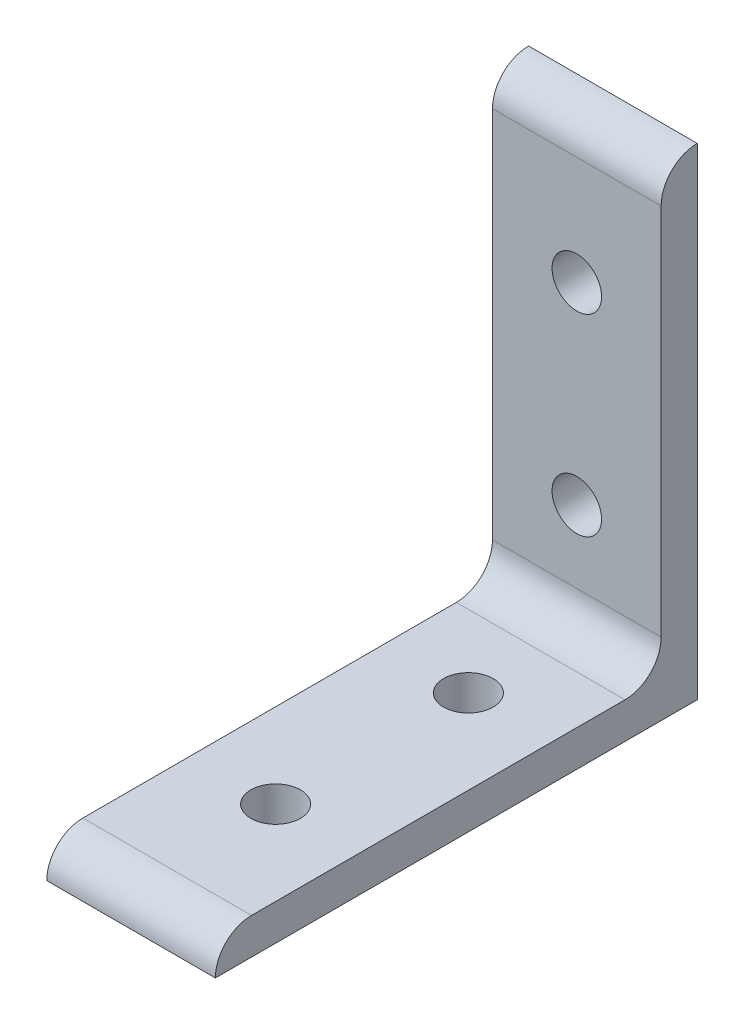
ISO-10303-21;
HEADER;
FILE_DESCRIPTION(('STEP AP214'),'2;1');
FILE_NAME('part.step','',(''),(''),'','','');
FILE_SCHEMA(('AUTOMOTIVE_DESIGN { 1 0 10303 214 1 1 1 1 }'));
ENDSEC;
DATA;
#1=APPLICATION_CONTEXT('core data for automotive mechanical design processes');
#2=APPLICATION_PROTOCOL_DEFINITION('international standard','automotive_design',2000,#1);
#3=PRODUCT_CONTEXT('',#1,'mechanical');
#4=PRODUCT('Part','Part','',(#3));
#5=PRODUCT_RELATED_PRODUCT_CATEGORY('part','',(#4));
#6=PRODUCT_DEFINITION_FORMATION('','',#4);
#7=PRODUCT_DEFINITION_CONTEXT('part definition',#1,'design');
#8=PRODUCT_DEFINITION('design','',#6,#7);
#9=PRODUCT_DEFINITION_SHAPE('','',#8);
#10=(LENGTH_UNIT() NAMED_UNIT(*) SI_UNIT(.MILLI.,.METRE.));
#11=(NAMED_UNIT(*) PLANE_ANGLE_UNIT() SI_UNIT($,.RADIAN.));
#12=(NAMED_UNIT(*) SI_UNIT($,.STERADIAN.) SOLID_ANGLE_UNIT());
#13=UNCERTAINTY_MEASURE_WITH_UNIT(LENGTH_MEASURE(1.E-05),#10,'distance_accuracy_value','');
#14=(GEOMETRIC_REPRESENTATION_CONTEXT(3) GLOBAL_UNCERTAINTY_ASSIGNED_CONTEXT((#13)) GLOBAL_UNIT_ASSIGNED_CONTEXT((#10,
#11,#12)) REPRESENTATION_CONTEXT('',''));
#15=CARTESIAN_POINT('',(0.,0.,0.));
#16=DIRECTION('',(0.,0.,1.));
#17=DIRECTION('',(1.,0.,0.));
#18=AXIS2_PLACEMENT_3D('',#15,#16,#17);
#19=CARTESIAN_POINT('',(-11.1125,58.7427923729418,0.0052899634717105));
#20=DIRECTION('',(1.,0.,0.));
#21=DIRECTION('',(0.,0.,-1.));
#22=AXIS2_PLACEMENT_3D('',#19,#20,#21);
#23=CYLINDRICAL_SURFACE('',#22,4.7625);
#24=CARTESIAN_POINT('',(11.1125,58.7427923729418,0.0052899634717105));
#25=DIRECTION('',(1.,0.,0.));
#26=DIRECTION('',(0.,0.,-1.));
#27=AXIS2_PLACEMENT_3D('',#24,#25,#26);
#28=CIRCLE('',#27,4.7625);
#29=CARTESIAN_POINT('',(11.1125,63.5052923729418,0.00528996347171051));
#30=VERTEX_POINT('',#29);
#31=CARTESIAN_POINT('',(11.1125,58.7427923729418,4.76778996347171));
#32=VERTEX_POINT('',#31);
#33=EDGE_CURVE('E131',#30,#32,#28,.T.);
#34=ORIENTED_EDGE('',*,*,#33,.F.);
#35=DIRECTION('',(1.,0.,0.));
#36=VECTOR('',#35,1.);
#37=CARTESIAN_POINT('',(-11.1125,63.5052923729418,0.00528996347171051));
#38=LINE('',#37,#36);
#39=CARTESIAN_POINT('',(-11.1125,63.5052923729418,0.00528996347171051));
#40=VERTEX_POINT('',#39);
#41=EDGE_CURVE('E113',#40,#30,#38,.T.);
#42=ORIENTED_EDGE('',*,*,#41,.F.);
#43=CARTESIAN_POINT('',(-11.1125,58.7427923729418,0.0052899634717105));
#44=DIRECTION('',(1.,0.,0.));
#45=DIRECTION('',(0.,0.,-1.));
#46=AXIS2_PLACEMENT_3D('',#43,#44,#45);
#47=CIRCLE('',#46,4.7625);
#48=CARTESIAN_POINT('',(-11.1125,58.7427923729418,4.76778996347171));
#49=VERTEX_POINT('',#48);
#50=EDGE_CURVE('E108',#40,#49,#47,.T.);
#51=ORIENTED_EDGE('',*,*,#50,.T.);
#52=DIRECTION('',(1.,0.,0.));
#53=VECTOR('',#52,1.);
#54=CARTESIAN_POINT('',(-11.1125,58.7427923729418,4.76778996347171));
#55=LINE('',#54,#53);
#56=EDGE_CURVE('E90',#49,#32,#55,.T.);
#57=ORIENTED_EDGE('',*,*,#56,.T.);
#58=EDGE_LOOP('',(#34,#42,#51,#57));
#59=FACE_BOUND('',#58,.T.);
#60=ADVANCED_FACE('F33',(#59),#23,.T.);
#61=CARTESIAN_POINT('',(-11.1125,0.00529237294180183,0.00528996347171065));
#62=DIRECTION('',(0.,0.,-1.));
#63=DIRECTION('',(0.,1.,0.));
#64=AXIS2_PLACEMENT_3D('',#61,#62,#63);
#65=PLANE('',#64);
#66=CARTESIAN_POINT('',(0.,19.0552923729418,0.00528996347170945));
#67=DIRECTION('',(0.,0.,-1.));
#68=DIRECTION('',(0.,1.,0.));
#69=AXIS2_PLACEMENT_3D('',#66,#67,#68);
#70=CIRCLE('',#69,3.26389999999998);
#71=CARTESIAN_POINT('',(0.,22.3191923729418,0.00528996347170945));
#72=VERTEX_POINT('',#71);
#73=EDGE_CURVE('E161',#72,#72,#70,.T.);
#74=ORIENTED_EDGE('',*,*,#73,.F.);
#75=EDGE_LOOP('',(#74));
#76=FACE_BOUND('',#75,.T.);
#77=CARTESIAN_POINT('',(0.,44.4552923729418,0.0052899634717094));
#78=DIRECTION('',(0.,0.,-1.));
#79=DIRECTION('',(0.,1.,0.));
#80=AXIS2_PLACEMENT_3D('',#77,#78,#79);
#81=CIRCLE('',#80,3.26389999999998);
#82=CARTESIAN_POINT('',(0.,47.7191923729418,0.00528996347170939));
#83=VERTEX_POINT('',#82);
#84=EDGE_CURVE('E157',#83,#83,#81,.T.);
#85=ORIENTED_EDGE('',*,*,#84,.F.);
#86=EDGE_LOOP('',(#85));
#87=FACE_BOUND('',#86,.T.);
#88=DIRECTION('',(0.,1.,0.));
#89=VECTOR('',#88,1.);
#90=CARTESIAN_POINT('',(11.1125,0.00529237294180183,0.00528996347171065));
#91=LINE('',#90,#89);
#92=CARTESIAN_POINT('',(11.1125,0.00529237294180183,0.00528996347171065));
#93=VERTEX_POINT('',#92);
#94=EDGE_CURVE('E114',#93,#30,#91,.T.);
#95=ORIENTED_EDGE('',*,*,#94,.F.);
#96=DIRECTION('',(1.,0.,0.));
#97=VECTOR('',#96,1.);
#98=CARTESIAN_POINT('',(-11.1125,0.00529237294180183,0.00528996347171065));
#99=LINE('',#98,#97);
#100=CARTESIAN_POINT('',(-11.1125,0.00529237294180183,0.00528996347171065));
#101=VERTEX_POINT('',#100);
#102=EDGE_CURVE('E143',#101,#93,#99,.T.);
#103=ORIENTED_EDGE('',*,*,#102,.F.);
#104=DIRECTION('',(0.,1.,0.));
#105=VECTOR('',#104,1.);
#106=CARTESIAN_POINT('',(-11.1125,0.00529237294180183,0.00528996347171065));
#107=LINE('',#106,#105);
#108=EDGE_CURVE('E102',#101,#40,#107,.T.);
#109=ORIENTED_EDGE('',*,*,#108,.T.);
#110=ORIENTED_EDGE('',*,*,#41,.T.);
#111=EDGE_LOOP('',(#95,#103,#109,#110));
#112=FACE_BOUND('',#111,.T.);
#113=ADVANCED_FACE('F168',(#76,#87,#112),#65,.T.);
#114=CARTESIAN_POINT('',(-11.1125,0.00529237294179952,63.5052899634717));
#115=DIRECTION('',(0.,-1.,0.));
#116=DIRECTION('',(0.,0.,-1.));
#117=AXIS2_PLACEMENT_3D('',#114,#115,#116);
#118=PLANE('',#117);
#119=CARTESIAN_POINT('',(0.,0.00529237294179998,19.0552899634717));
#120=DIRECTION('',(0.,-1.,0.));
#121=DIRECTION('',(0.,0.,-1.));
#122=AXIS2_PLACEMENT_3D('',#119,#120,#121);
#123=CIRCLE('',#122,3.26389999999999);
#124=CARTESIAN_POINT('',(0.,0.00529237294179998,15.7913899634717));
#125=VERTEX_POINT('',#124);
#126=EDGE_CURVE('E153',#125,#125,#123,.T.);
#127=ORIENTED_EDGE('',*,*,#126,.F.);
#128=EDGE_LOOP('',(#127));
#129=FACE_BOUND('',#128,.T.);
#130=CARTESIAN_POINT('',(0.,0.00529237294179905,44.4552899634717));
#131=DIRECTION('',(0.,-1.,0.));
#132=DIRECTION('',(0.,0.,-1.));
#133=AXIS2_PLACEMENT_3D('',#130,#131,#132);
#134=CIRCLE('',#133,3.26389999999999);
#135=CARTESIAN_POINT('',(0.,0.00529237294179905,41.1913899634717));
#136=VERTEX_POINT('',#135);
#137=EDGE_CURVE('E152',#136,#136,#134,.T.);
#138=ORIENTED_EDGE('',*,*,#137,.F.);
#139=EDGE_LOOP('',(#138));
#140=FACE_BOUND('',#139,.T.);
#141=DIRECTION('',(0.,0.,-1.));
#142=VECTOR('',#141,1.);
#143=CARTESIAN_POINT('',(11.1125,0.00529237294179952,63.5052899634717));
#144=LINE('',#143,#142);
#145=CARTESIAN_POINT('',(11.1125,0.00529237294180015,63.5052899634717));
#146=VERTEX_POINT('',#145);
#147=EDGE_CURVE('E117',#146,#93,#144,.T.);
#148=ORIENTED_EDGE('',*,*,#147,.F.);
#149=DIRECTION('',(1.,0.,0.));
#150=VECTOR('',#149,1.);
#151=CARTESIAN_POINT('',(-11.1125,0.00529237294180015,63.5052899634717));
#152=LINE('',#151,#150);
#153=CARTESIAN_POINT('',(-11.1125,0.00529237294180015,63.5052899634717));
#154=VERTEX_POINT('',#153);
#155=EDGE_CURVE('E145',#154,#146,#152,.T.);
#156=ORIENTED_EDGE('',*,*,#155,.F.);
#157=DIRECTION('',(0.,0.,-1.));
#158=VECTOR('',#157,1.);
#159=CARTESIAN_POINT('',(-11.1125,0.00529237294179952,63.5052899634717));
#160=LINE('',#159,#158);
#161=EDGE_CURVE('E127',#154,#101,#160,.T.);
#162=ORIENTED_EDGE('',*,*,#161,.T.);
#163=ORIENTED_EDGE('',*,*,#102,.T.);
#164=EDGE_LOOP('',(#148,#156,#162,#163));
#165=FACE_BOUND('',#164,.T.);
#166=ADVANCED_FACE('F189',(#129,#140,#165),#118,.T.);
#167=CARTESIAN_POINT('',(-11.1125,0.00529237294179956,58.7427899634717));
#168=DIRECTION('',(1.,0.,0.));
#169=DIRECTION('',(0.,0.,-1.));
#170=AXIS2_PLACEMENT_3D('',#167,#168,#169);
#171=CYLINDRICAL_SURFACE('',#170,4.7625);
#172=CARTESIAN_POINT('',(11.1125,0.00529237294179956,58.7427899634717));
#173=DIRECTION('',(1.,0.,0.));
#174=DIRECTION('',(0.,0.,-1.));
#175=AXIS2_PLACEMENT_3D('',#172,#173,#174);
#176=CIRCLE('',#175,4.7625);
#177=CARTESIAN_POINT('',(11.1125,4.7677923729418,58.7427899634717));
#178=VERTEX_POINT('',#177);
#179=EDGE_CURVE('E136',#178,#146,#176,.T.);
#180=ORIENTED_EDGE('',*,*,#179,.F.);
#181=DIRECTION('',(1.,0.,0.));
#182=VECTOR('',#181,1.);
#183=CARTESIAN_POINT('',(-11.1125,4.7677923729418,58.7427899634717));
#184=LINE('',#183,#182);
#185=CARTESIAN_POINT('',(-11.1125,4.7677923729418,58.7427899634717));
#186=VERTEX_POINT('',#185);
#187=EDGE_CURVE('E101',#186,#178,#184,.T.);
#188=ORIENTED_EDGE('',*,*,#187,.F.);
#189=CARTESIAN_POINT('',(-11.1125,0.00529237294179956,58.7427899634717));
#190=DIRECTION('',(1.,0.,0.));
#191=DIRECTION('',(0.,0.,-1.));
#192=AXIS2_PLACEMENT_3D('',#189,#190,#191);
#193=CIRCLE('',#192,4.7625);
#194=EDGE_CURVE('E124',#186,#154,#193,.T.);
#195=ORIENTED_EDGE('',*,*,#194,.T.);
#196=ORIENTED_EDGE('',*,*,#155,.T.);
#197=EDGE_LOOP('',(#180,#188,#195,#196));
#198=FACE_BOUND('',#197,.T.);
#199=ADVANCED_FACE('F175',(#198),#171,.T.);
#200=CARTESIAN_POINT('',(-11.1125,4.7677923729418,4.76778996347171));
#201=DIRECTION('',(0.,1.,0.));
#202=DIRECTION('',(0.,0.,1.));
#203=AXIS2_PLACEMENT_3D('',#200,#201,#202);
#204=PLANE('',#203);
#205=CARTESIAN_POINT('',(0.,4.7677923729418,19.0552899634717));
#206=DIRECTION('',(0.,1.,0.));
#207=DIRECTION('',(0.,0.,1.));
#208=AXIS2_PLACEMENT_3D('',#205,#206,#207);
#209=CIRCLE('',#208,3.26389999999998);
#210=CARTESIAN_POINT('',(0.,4.7677923729418,22.3191899634717));
#211=VERTEX_POINT('',#210);
#212=EDGE_CURVE('E149',#211,#211,#209,.T.);
#213=ORIENTED_EDGE('',*,*,#212,.F.);
#214=EDGE_LOOP('',(#213));
#215=FACE_BOUND('',#214,.T.);
#216=CARTESIAN_POINT('',(0.,4.7677923729418,44.4552899634717));
#217=DIRECTION('',(0.,1.,0.));
#218=DIRECTION('',(0.,0.,1.));
#219=AXIS2_PLACEMENT_3D('',#216,#217,#218);
#220=CIRCLE('',#219,3.26389999999998);
#221=CARTESIAN_POINT('',(0.,4.7677923729418,47.7191899634717));
#222=VERTEX_POINT('',#221);
#223=EDGE_CURVE('E120',#222,#222,#220,.T.);
#224=ORIENTED_EDGE('',*,*,#223,.F.);
#225=EDGE_LOOP('',(#224));
#226=FACE_BOUND('',#225,.T.);
#227=DIRECTION('',(0.,0.,1.));
#228=VECTOR('',#227,1.);
#229=CARTESIAN_POINT('',(11.1125,4.7677923729418,4.76778996347171));
#230=LINE('',#229,#228);
#231=CARTESIAN_POINT('',(11.1125,4.7677923729418,9.53028996347171));
#232=VERTEX_POINT('',#231);
#233=EDGE_CURVE('E134',#232,#178,#230,.T.);
#234=ORIENTED_EDGE('',*,*,#233,.F.);
#235=DIRECTION('',(1.,0.,0.));
#236=VECTOR('',#235,1.);
#237=CARTESIAN_POINT('',(-11.1125,4.7677923729418,9.53028996347171));
#238=LINE('',#237,#236);
#239=CARTESIAN_POINT('',(-11.1125,4.7677923729418,9.53028996347171));
#240=VERTEX_POINT('',#239);
#241=EDGE_CURVE('E48',#232,#240,#238,.F.);
#242=ORIENTED_EDGE('',*,*,#241,.T.);
#243=DIRECTION('',(0.,0.,1.));
#244=VECTOR('',#243,1.);
#245=CARTESIAN_POINT('',(-11.1125,4.7677923729418,4.76778996347171));
#246=LINE('',#245,#244);
#247=EDGE_CURVE('E111',#240,#186,#246,.T.);
#248=ORIENTED_EDGE('',*,*,#247,.T.);
#249=ORIENTED_EDGE('',*,*,#187,.T.);
#250=EDGE_LOOP('',(#234,#242,#248,#249));
#251=FACE_BOUND('',#250,.T.);
#252=ADVANCED_FACE('F176',(#215,#226,#251),#204,.T.);
#253=CARTESIAN_POINT('',(-11.1125,58.7427923729418,4.76778996347171));
#254=DIRECTION('',(0.,0.,1.));
#255=DIRECTION('',(1.,0.,0.));
#256=AXIS2_PLACEMENT_3D('',#253,#254,#255);
#257=PLANE('',#256);
#258=CARTESIAN_POINT('',(0.,19.0552923729418,4.76778996347171));
#259=DIRECTION('',(0.,0.,1.));
#260=DIRECTION('',(1.,0.,0.));
#261=AXIS2_PLACEMENT_3D('',#258,#259,#260);
#262=CIRCLE('',#261,3.26389999999997);
#263=CARTESIAN_POINT('',(3.26389999999997,19.0552923729418,4.76778996347171));
#264=VERTEX_POINT('',#263);
#265=EDGE_CURVE('E158',#264,#264,#262,.T.);
#266=ORIENTED_EDGE('',*,*,#265,.F.);
#267=EDGE_LOOP('',(#266));
#268=FACE_BOUND('',#267,.T.);
#269=CARTESIAN_POINT('',(0.,44.4552923729418,4.76778996347171));
#270=DIRECTION('',(0.,0.,1.));
#271=DIRECTION('',(1.,0.,0.));
#272=AXIS2_PLACEMENT_3D('',#269,#270,#271);
#273=CIRCLE('',#272,3.26389999999997);
#274=CARTESIAN_POINT('',(3.26389999999997,44.4552923729418,4.76778996347171));
#275=VERTEX_POINT('',#274);
#276=EDGE_CURVE('E154',#275,#275,#273,.T.);
#277=ORIENTED_EDGE('',*,*,#276,.F.);
#278=EDGE_LOOP('',(#277));
#279=FACE_BOUND('',#278,.T.);
#280=DIRECTION('',(0.,-1.,0.));
#281=VECTOR('',#280,1.);
#282=CARTESIAN_POINT('',(-11.1125,58.7427923729418,4.76778996347171));
#283=LINE('',#282,#281);
#284=CARTESIAN_POINT('',(-11.1125,9.5302923729418,4.76778996347171));
#285=VERTEX_POINT('',#284);
#286=EDGE_CURVE('E94',#49,#285,#283,.T.);
#287=ORIENTED_EDGE('',*,*,#286,.T.);
#288=DIRECTION('',(1.,0.,0.));
#289=VECTOR('',#288,1.);
#290=CARTESIAN_POINT('',(11.1125,9.5302923729418,4.76778996347171));
#291=LINE('',#290,#289);
#292=CARTESIAN_POINT('',(11.1125,9.5302923729418,4.76778996347171));
#293=VERTEX_POINT('',#292);
#294=EDGE_CURVE('E142',#285,#293,#291,.T.);
#295=ORIENTED_EDGE('',*,*,#294,.T.);
#296=DIRECTION('',(0.,-1.,0.));
#297=VECTOR('',#296,1.);
#298=CARTESIAN_POINT('',(11.1125,58.7427923729418,4.76778996347171));
#299=LINE('',#298,#297);
#300=EDGE_CURVE('E96',#32,#293,#299,.T.);
#301=ORIENTED_EDGE('',*,*,#300,.F.);
#302=ORIENTED_EDGE('',*,*,#56,.F.);
#303=EDGE_LOOP('',(#287,#295,#301,#302));
#304=FACE_BOUND('',#303,.T.);
#305=ADVANCED_FACE('F92',(#268,#279,#304),#257,.T.);
#306=CARTESIAN_POINT('',(-11.1125,58.7427923729418,0.0052899634717105));
#307=DIRECTION('',(1.,0.,0.));
#308=DIRECTION('',(0.,0.,-1.));
#309=AXIS2_PLACEMENT_3D('',#306,#307,#308);
#310=PLANE('',#309);
#311=ORIENTED_EDGE('',*,*,#50,.F.);
#312=ORIENTED_EDGE('',*,*,#108,.F.);
#313=ORIENTED_EDGE('',*,*,#161,.F.);
#314=ORIENTED_EDGE('',*,*,#194,.F.);
#315=ORIENTED_EDGE('',*,*,#247,.F.);
#316=CARTESIAN_POINT('',(-11.1125,9.5302923729418,9.53028996347171));
#317=DIRECTION('',(1.,0.,0.));
#318=DIRECTION('',(0.,0.,-1.));
#319=AXIS2_PLACEMENT_3D('',#316,#317,#318);
#320=CIRCLE('',#319,4.7625);
#321=EDGE_CURVE('E11',#240,#285,#320,.T.);
#322=ORIENTED_EDGE('',*,*,#321,.T.);
#323=ORIENTED_EDGE('',*,*,#286,.F.);
#324=EDGE_LOOP('',(#311,#312,#313,#314,#315,#322,#323));
#325=FACE_BOUND('',#324,.T.);
#326=ADVANCED_FACE('F106',(#325),#310,.F.);
#327=CARTESIAN_POINT('',(11.1125,58.7427923729418,0.0052899634717105));
#328=DIRECTION('',(1.,0.,0.));
#329=DIRECTION('',(0.,0.,-1.));
#330=AXIS2_PLACEMENT_3D('',#327,#328,#329);
#331=PLANE('',#330);
#332=ORIENTED_EDGE('',*,*,#33,.T.);
#333=ORIENTED_EDGE('',*,*,#300,.T.);
#334=CARTESIAN_POINT('',(11.1125,9.5302923729418,9.53028996347171));
#335=DIRECTION('',(1.,0.,0.));
#336=DIRECTION('',(0.,0.,-1.));
#337=AXIS2_PLACEMENT_3D('',#334,#335,#336);
#338=CIRCLE('',#337,4.7625);
#339=EDGE_CURVE('E41',#293,#232,#338,.F.);
#340=ORIENTED_EDGE('',*,*,#339,.T.);
#341=ORIENTED_EDGE('',*,*,#233,.T.);
#342=ORIENTED_EDGE('',*,*,#179,.T.);
#343=ORIENTED_EDGE('',*,*,#147,.T.);
#344=ORIENTED_EDGE('',*,*,#94,.T.);
#345=EDGE_LOOP('',(#332,#333,#340,#341,#342,#343,#344));
#346=FACE_BOUND('',#345,.T.);
#347=ADVANCED_FACE('F164',(#346),#331,.T.);
#348=CARTESIAN_POINT('',(0.,0.00529237294180021,44.4552899634717));
#349=DIRECTION('',(0.,-1.,0.));
#350=DIRECTION('',(0.,0.,-1.));
#351=AXIS2_PLACEMENT_3D('',#348,#349,#350);
#352=CYLINDRICAL_SURFACE('',#351,3.26389999999998);
#353=ORIENTED_EDGE('',*,*,#223,.T.);
#354=EDGE_LOOP('',(#353));
#355=FACE_BOUND('',#354,.T.);
#356=ORIENTED_EDGE('',*,*,#137,.T.);
#357=EDGE_LOOP('',(#356));
#358=FACE_BOUND('',#357,.T.);
#359=ADVANCED_FACE('F206',(#355,#358),#352,.F.);
#360=CARTESIAN_POINT('',(0.,0.00529237294180114,19.0552899634717));
#361=DIRECTION('',(0.,-1.,0.));
#362=DIRECTION('',(0.,0.,-1.));
#363=AXIS2_PLACEMENT_3D('',#360,#361,#362);
#364=CYLINDRICAL_SURFACE('',#363,3.26389999999998);
#365=ORIENTED_EDGE('',*,*,#212,.T.);
#366=EDGE_LOOP('',(#365));
#367=FACE_BOUND('',#366,.T.);
#368=ORIENTED_EDGE('',*,*,#126,.T.);
#369=EDGE_LOOP('',(#368));
#370=FACE_BOUND('',#369,.T.);
#371=ADVANCED_FACE('F211',(#367,#370),#364,.F.);
#372=CARTESIAN_POINT('',(0.,44.4552923729418,0.00528996347171055));
#373=DIRECTION('',(0.,0.,-1.));
#374=DIRECTION('',(0.,1.,0.));
#375=AXIS2_PLACEMENT_3D('',#372,#373,#374);
#376=CYLINDRICAL_SURFACE('',#375,3.26389999999997);
#377=ORIENTED_EDGE('',*,*,#276,.T.);
#378=EDGE_LOOP('',(#377));
#379=FACE_BOUND('',#378,.T.);
#380=ORIENTED_EDGE('',*,*,#84,.T.);
#381=EDGE_LOOP('',(#380));
#382=FACE_BOUND('',#381,.T.);
#383=ADVANCED_FACE('F182',(#379,#382),#376,.F.);
#384=CARTESIAN_POINT('',(0.,19.0552923729418,0.00528996347171061));
#385=DIRECTION('',(0.,0.,-1.));
#386=DIRECTION('',(0.,1.,0.));
#387=AXIS2_PLACEMENT_3D('',#384,#385,#386);
#388=CYLINDRICAL_SURFACE('',#387,3.26389999999997);
#389=ORIENTED_EDGE('',*,*,#265,.T.);
#390=EDGE_LOOP('',(#389));
#391=FACE_BOUND('',#390,.T.);
#392=ORIENTED_EDGE('',*,*,#73,.T.);
#393=EDGE_LOOP('',(#392));
#394=FACE_BOUND('',#393,.T.);
#395=ADVANCED_FACE('F178',(#391,#394),#388,.F.);
#396=CARTESIAN_POINT('',(-11.1125,9.5302923729418,9.53028996347171));
#397=DIRECTION('',(-1.,0.,0.));
#398=DIRECTION('',(0.,0.,1.));
#399=AXIS2_PLACEMENT_3D('',#396,#397,#398);
#400=CYLINDRICAL_SURFACE('',#399,4.7625);
#401=ORIENTED_EDGE('',*,*,#321,.F.);
#402=ORIENTED_EDGE('',*,*,#241,.F.);
#403=ORIENTED_EDGE('',*,*,#339,.F.);
#404=ORIENTED_EDGE('',*,*,#294,.F.);
#405=EDGE_LOOP('',(#401,#402,#403,#404));
#406=FACE_BOUND('',#405,.T.);
#407=ADVANCED_FACE('F35',(#406),#400,.F.);
#408=CLOSED_SHELL('',(#60,#113,#166,#199,#252,#305,#326,#347,#359,#371,#383,#395,#407));
#409=MANIFOLD_SOLID_BREP('B2',#408);
#410=ADVANCED_BREP_SHAPE_REPRESENTATION('',(#18,#409),#14);
#411=SHAPE_DEFINITION_REPRESENTATION(#9,#410);
ENDSEC;
END-ISO-10303-21;
